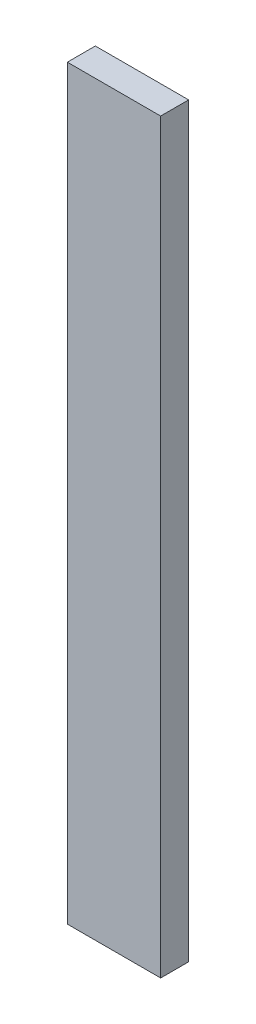
ISO-10303-21;
HEADER;
FILE_DESCRIPTION(('STEP AP214'),'2;1');
FILE_NAME('part.step','',(''),(''),'','','');
FILE_SCHEMA(('AUTOMOTIVE_DESIGN { 1 0 10303 214 1 1 1 1 }'));
ENDSEC;
DATA;
#1=APPLICATION_CONTEXT('core data for automotive mechanical design processes');
#2=APPLICATION_PROTOCOL_DEFINITION('international standard','automotive_design',2000,#1);
#3=PRODUCT_CONTEXT('',#1,'mechanical');
#4=PRODUCT('Part','Part','',(#3));
#5=PRODUCT_RELATED_PRODUCT_CATEGORY('part','',(#4));
#6=PRODUCT_DEFINITION_FORMATION('','',#4);
#7=PRODUCT_DEFINITION_CONTEXT('part definition',#1,'design');
#8=PRODUCT_DEFINITION('design','',#6,#7);
#9=PRODUCT_DEFINITION_SHAPE('','',#8);
#10=(LENGTH_UNIT() NAMED_UNIT(*) SI_UNIT(.MILLI.,.METRE.));
#11=(NAMED_UNIT(*) PLANE_ANGLE_UNIT() SI_UNIT($,.RADIAN.));
#12=(NAMED_UNIT(*) SI_UNIT($,.STERADIAN.) SOLID_ANGLE_UNIT());
#13=UNCERTAINTY_MEASURE_WITH_UNIT(LENGTH_MEASURE(1.E-05),#10,'distance_accuracy_value','');
#14=(GEOMETRIC_REPRESENTATION_CONTEXT(3) GLOBAL_UNCERTAINTY_ASSIGNED_CONTEXT((#13)) GLOBAL_UNIT_ASSIGNED_CONTEXT((#10,
#11,#12)) REPRESENTATION_CONTEXT('',''));
#15=CARTESIAN_POINT('',(0.,0.,0.));
#16=DIRECTION('',(0.,0.,1.));
#17=DIRECTION('',(1.,0.,0.));
#18=AXIS2_PLACEMENT_3D('',#15,#16,#17);
#19=CARTESIAN_POINT('',(5.,40.,3.));
#20=DIRECTION('',(-1.,0.,0.));
#21=DIRECTION('',(0.,-1.,0.));
#22=AXIS2_PLACEMENT_3D('',#19,#20,#21);
#23=PLANE('',#22);
#24=DIRECTION('',(0.,1.,0.));
#25=VECTOR('',#24,1.);
#26=CARTESIAN_POINT('',(5.,40.,0.));
#27=LINE('',#26,#25);
#28=CARTESIAN_POINT('',(5.00000000000001,-40.,0.));
#29=VERTEX_POINT('',#28);
#30=CARTESIAN_POINT('',(5.,40.,0.));
#31=VERTEX_POINT('',#30);
#32=EDGE_CURVE('E95',#29,#31,#27,.T.);
#33=ORIENTED_EDGE('',*,*,#32,.T.);
#34=DIRECTION('',(0.,0.,-1.));
#35=VECTOR('',#34,1.);
#36=CARTESIAN_POINT('',(5.,40.,3.));
#37=LINE('',#36,#35);
#38=CARTESIAN_POINT('',(5.,40.,3.));
#39=VERTEX_POINT('',#38);
#40=EDGE_CURVE('E11',#39,#31,#37,.T.);
#41=ORIENTED_EDGE('',*,*,#40,.F.);
#42=DIRECTION('',(0.,1.,0.));
#43=VECTOR('',#42,1.);
#44=CARTESIAN_POINT('',(5.,40.,3.));
#45=LINE('',#44,#43);
#46=CARTESIAN_POINT('',(5.00000000000001,-40.,3.));
#47=VERTEX_POINT('',#46);
#48=EDGE_CURVE('E83',#47,#39,#45,.T.);
#49=ORIENTED_EDGE('',*,*,#48,.F.);
#50=DIRECTION('',(0.,0.,-1.));
#51=VECTOR('',#50,1.);
#52=CARTESIAN_POINT('',(5.00000000000001,-40.,3.));
#53=LINE('',#52,#51);
#54=EDGE_CURVE('E91',#47,#29,#53,.T.);
#55=ORIENTED_EDGE('',*,*,#54,.T.);
#56=EDGE_LOOP('',(#33,#41,#49,#55));
#57=FACE_BOUND('',#56,.T.);
#58=ADVANCED_FACE('F32',(#57),#23,.F.);
#59=CARTESIAN_POINT('',(-5.,40.,3.));
#60=DIRECTION('',(0.,-1.,0.));
#61=DIRECTION('',(0.,0.,-1.));
#62=AXIS2_PLACEMENT_3D('',#59,#60,#61);
#63=PLANE('',#62);
#64=DIRECTION('',(-1.,0.,0.));
#65=VECTOR('',#64,1.);
#66=CARTESIAN_POINT('',(-5.,40.,0.));
#67=LINE('',#66,#65);
#68=CARTESIAN_POINT('',(-5.,40.,0.));
#69=VERTEX_POINT('',#68);
#70=EDGE_CURVE('E87',#31,#69,#67,.T.);
#71=ORIENTED_EDGE('',*,*,#70,.T.);
#72=DIRECTION('',(0.,0.,-1.));
#73=VECTOR('',#72,1.);
#74=CARTESIAN_POINT('',(-5.,40.,3.));
#75=LINE('',#74,#73);
#76=CARTESIAN_POINT('',(-5.,40.,3.));
#77=VERTEX_POINT('',#76);
#78=EDGE_CURVE('E40',#77,#69,#75,.T.);
#79=ORIENTED_EDGE('',*,*,#78,.F.);
#80=DIRECTION('',(-1.,0.,0.));
#81=VECTOR('',#80,1.);
#82=CARTESIAN_POINT('',(-5.,40.,3.));
#83=LINE('',#82,#81);
#84=EDGE_CURVE('E78',#39,#77,#83,.T.);
#85=ORIENTED_EDGE('',*,*,#84,.F.);
#86=ORIENTED_EDGE('',*,*,#40,.T.);
#87=EDGE_LOOP('',(#71,#79,#85,#86));
#88=FACE_BOUND('',#87,.T.);
#89=ADVANCED_FACE('F86',(#88),#63,.F.);
#90=CARTESIAN_POINT('',(-5.,40.,3.));
#91=DIRECTION('',(1.,0.,0.));
#92=DIRECTION('',(0.,1.,0.));
#93=AXIS2_PLACEMENT_3D('',#90,#91,#92);
#94=PLANE('',#93);
#95=DIRECTION('',(0.,-1.,0.));
#96=VECTOR('',#95,1.);
#97=CARTESIAN_POINT('',(-5.,40.,0.));
#98=LINE('',#97,#96);
#99=CARTESIAN_POINT('',(-5.,-40.,0.));
#100=VERTEX_POINT('',#99);
#101=EDGE_CURVE('E65',#69,#100,#98,.T.);
#102=ORIENTED_EDGE('',*,*,#101,.T.);
#103=DIRECTION('',(0.,0.,-1.));
#104=VECTOR('',#103,1.);
#105=CARTESIAN_POINT('',(-5.,-40.,3.));
#106=LINE('',#105,#104);
#107=CARTESIAN_POINT('',(-5.,-40.,3.));
#108=VERTEX_POINT('',#107);
#109=EDGE_CURVE('E88',#108,#100,#106,.T.);
#110=ORIENTED_EDGE('',*,*,#109,.F.);
#111=DIRECTION('',(0.,-1.,0.));
#112=VECTOR('',#111,1.);
#113=CARTESIAN_POINT('',(-5.,40.,3.));
#114=LINE('',#113,#112);
#115=EDGE_CURVE('E81',#77,#108,#114,.T.);
#116=ORIENTED_EDGE('',*,*,#115,.F.);
#117=ORIENTED_EDGE('',*,*,#78,.T.);
#118=EDGE_LOOP('',(#102,#110,#116,#117));
#119=FACE_BOUND('',#118,.T.);
#120=ADVANCED_FACE('F89',(#119),#94,.F.);
#121=CARTESIAN_POINT('',(-5.,-40.,3.));
#122=DIRECTION('',(0.,1.,0.));
#123=DIRECTION('',(0.,0.,1.));
#124=AXIS2_PLACEMENT_3D('',#121,#122,#123);
#125=PLANE('',#124);
#126=DIRECTION('',(1.,0.,0.));
#127=VECTOR('',#126,1.);
#128=CARTESIAN_POINT('',(-5.,-40.,0.));
#129=LINE('',#128,#127);
#130=EDGE_CURVE('E71',#100,#29,#129,.T.);
#131=ORIENTED_EDGE('',*,*,#130,.T.);
#132=ORIENTED_EDGE('',*,*,#54,.F.);
#133=DIRECTION('',(1.,0.,0.));
#134=VECTOR('',#133,1.);
#135=CARTESIAN_POINT('',(-5.,-40.,3.));
#136=LINE('',#135,#134);
#137=EDGE_CURVE('E48',#108,#47,#136,.T.);
#138=ORIENTED_EDGE('',*,*,#137,.F.);
#139=ORIENTED_EDGE('',*,*,#109,.T.);
#140=EDGE_LOOP('',(#131,#132,#138,#139));
#141=FACE_BOUND('',#140,.T.);
#142=ADVANCED_FACE('F102',(#141),#125,.F.);
#143=CARTESIAN_POINT('',(0.,0.,3.));
#144=DIRECTION('',(0.,0.,1.));
#145=DIRECTION('',(1.,0.,0.));
#146=AXIS2_PLACEMENT_3D('',#143,#144,#145);
#147=PLANE('',#146);
#148=ORIENTED_EDGE('',*,*,#48,.T.);
#149=ORIENTED_EDGE('',*,*,#84,.T.);
#150=ORIENTED_EDGE('',*,*,#115,.T.);
#151=ORIENTED_EDGE('',*,*,#137,.T.);
#152=EDGE_LOOP('',(#148,#149,#150,#151));
#153=FACE_BOUND('',#152,.T.);
#154=ADVANCED_FACE('F79',(#153),#147,.T.);
#155=CARTESIAN_POINT('',(0.,0.,0.));
#156=DIRECTION('',(0.,0.,1.));
#157=DIRECTION('',(1.,0.,0.));
#158=AXIS2_PLACEMENT_3D('',#155,#156,#157);
#159=PLANE('',#158);
#160=ORIENTED_EDGE('',*,*,#32,.F.);
#161=ORIENTED_EDGE('',*,*,#130,.F.);
#162=ORIENTED_EDGE('',*,*,#101,.F.);
#163=ORIENTED_EDGE('',*,*,#70,.F.);
#164=EDGE_LOOP('',(#160,#161,#162,#163));
#165=FACE_BOUND('',#164,.T.);
#166=ADVANCED_FACE('F105',(#165),#159,.F.);
#167=CLOSED_SHELL('',(#58,#89,#120,#142,#154,#166));
#168=MANIFOLD_SOLID_BREP('B2',#167);
#169=ADVANCED_BREP_SHAPE_REPRESENTATION('',(#18,#168),#14);
#170=SHAPE_DEFINITION_REPRESENTATION(#9,#169);
ENDSEC;
END-ISO-10303-21;
